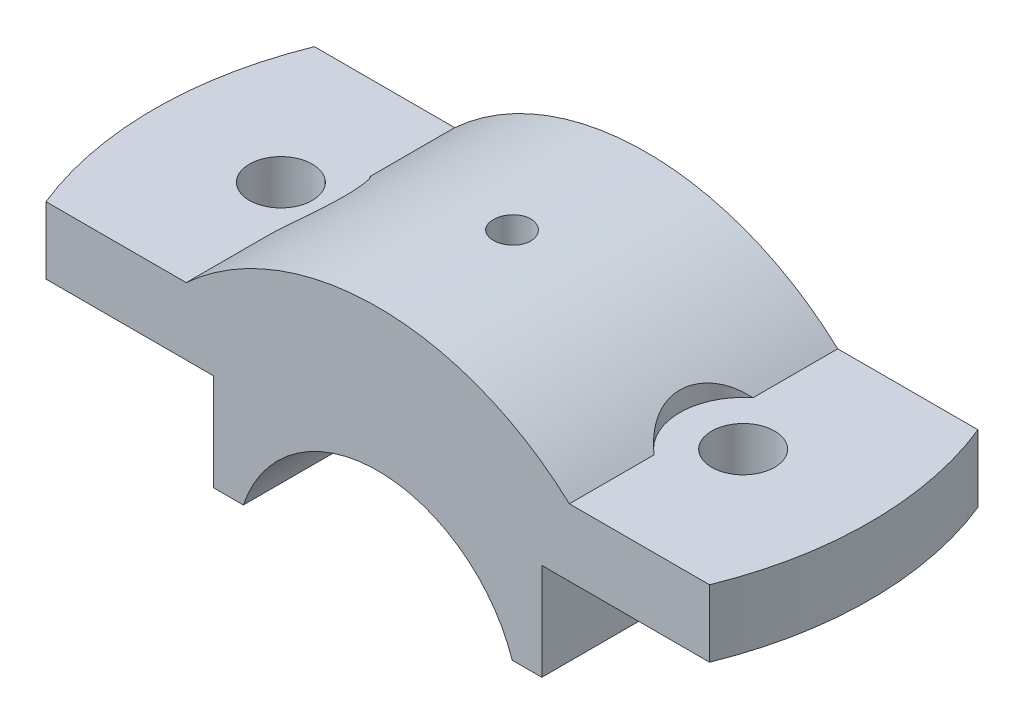
ISO-10303-21;
HEADER;
FILE_DESCRIPTION(('STEP AP214'),'2;1');
FILE_NAME('part.step','',(''),(''),'','','');
FILE_SCHEMA(('AUTOMOTIVE_DESIGN { 1 0 10303 214 1 1 1 1 }'));
ENDSEC;
DATA;
#1=APPLICATION_CONTEXT('core data for automotive mechanical design processes');
#2=APPLICATION_PROTOCOL_DEFINITION('international standard','automotive_design',2000,#1);
#3=PRODUCT_CONTEXT('',#1,'mechanical');
#4=PRODUCT('Part','Part','',(#3));
#5=PRODUCT_RELATED_PRODUCT_CATEGORY('part','',(#4));
#6=PRODUCT_DEFINITION_FORMATION('','',#4);
#7=PRODUCT_DEFINITION_CONTEXT('part definition',#1,'design');
#8=PRODUCT_DEFINITION('design','',#6,#7);
#9=PRODUCT_DEFINITION_SHAPE('','',#8);
#10=(LENGTH_UNIT() NAMED_UNIT(*) SI_UNIT(.MILLI.,.METRE.));
#11=(NAMED_UNIT(*) PLANE_ANGLE_UNIT() SI_UNIT($,.RADIAN.));
#12=(NAMED_UNIT(*) SI_UNIT($,.STERADIAN.) SOLID_ANGLE_UNIT());
#13=UNCERTAINTY_MEASURE_WITH_UNIT(LENGTH_MEASURE(1.E-05),#10,'distance_accuracy_value','');
#14=(GEOMETRIC_REPRESENTATION_CONTEXT(3) GLOBAL_UNCERTAINTY_ASSIGNED_CONTEXT((#13)) GLOBAL_UNIT_ASSIGNED_CONTEXT((#10,
#11,#12)) REPRESENTATION_CONTEXT('',''));
#15=CARTESIAN_POINT('',(0.,0.,0.));
#16=DIRECTION('',(0.,0.,1.));
#17=DIRECTION('',(1.,0.,0.));
#18=AXIS2_PLACEMENT_3D('',#15,#16,#17);
#19=CARTESIAN_POINT('',(0.,0.,18.));
#20=DIRECTION('',(0.,0.,-1.));
#21=DIRECTION('',(-1.,0.,0.));
#22=AXIS2_PLACEMENT_3D('',#19,#20,#21);
#23=CYLINDRICAL_SURFACE('',#22,38.);
#24=CARTESIAN_POINT('',(0.,38.,-2.5));
#25=CARTESIAN_POINT('',(0.140263338640118,37.9999989089088,-2.49999383429658));
#26=CARTESIAN_POINT('',(0.28062451056721,37.9992151008519,-2.48815604592353));
#27=CARTESIAN_POINT('',(0.55747007747557,37.9961636901737,-2.44110328347415));
#28=CARTESIAN_POINT('',(0.693949785301594,37.993894366974,-2.40586120099058));
#29=CARTESIAN_POINT('',(0.958982303444856,37.9881286089382,-2.31301742899112));
#30=CARTESIAN_POINT('',(1.08753929536543,37.9846328280609,-2.25542765374311));
#31=CARTESIAN_POINT('',(1.33312858370056,37.9768071728354,-2.11954286257648));
#32=CARTESIAN_POINT('',(1.45016348693039,37.9724774878122,-2.04125254489449));
#33=CARTESIAN_POINT('',(1.66961202724024,37.9634626250822,-1.86604841348535));
#34=CARTESIAN_POINT('',(1.77200420008546,37.9587769406168,-1.76910773898099));
#35=CARTESIAN_POINT('',(1.95907706932224,37.9495824974991,-1.55941033384726));
#36=CARTESIAN_POINT('',(2.04375702050909,37.9450737462974,-1.44665293809568));
#37=CARTESIAN_POINT('',(2.19306912808149,37.9367376727092,-1.20839964171994));
#38=CARTESIAN_POINT('',(2.25768324964759,37.9329109646397,-1.08289241542834));
#39=CARTESIAN_POINT('',(2.36491418395719,37.9263771482206,-0.822781472424069));
#40=CARTESIAN_POINT('',(2.40753125425532,37.9236700267624,-0.688177862238176));
#41=CARTESIAN_POINT('',(2.46949823281524,37.9196855382056,-0.413903543359487));
#42=CARTESIAN_POINT('',(2.4888820420221,37.9184060881012,-0.274240524678777));
#43=CARTESIAN_POINT('',(2.50393692695256,37.9174149912351,0.00636230037308772));
#44=CARTESIAN_POINT('',(2.49960829570425,37.9177033250994,0.147302090944959));
#45=CARTESIAN_POINT('',(2.46738928684178,37.9198133472868,0.42622651475829));
#46=CARTESIAN_POINT('',(2.43953561602796,37.9216326467839,0.564215408645128));
#47=CARTESIAN_POINT('',(2.36111413978203,37.9265958226422,0.833554930876449));
#48=CARTESIAN_POINT('',(2.31054618626762,37.9297397076388,0.964905515937279));
#49=CARTESIAN_POINT('',(2.18808999165326,37.9370005183096,1.21735765586783));
#50=CARTESIAN_POINT('',(2.1161851246853,37.9411182022647,1.33845112338592));
#51=CARTESIAN_POINT('',(1.95310825671474,37.949861837488,1.56686321005671));
#52=CARTESIAN_POINT('',(1.86193601494282,37.9544877951075,1.67418165704681));
#53=CARTESIAN_POINT('',(1.66270582371165,37.9637372885605,1.87221087327149));
#54=CARTESIAN_POINT('',(1.5546161115177,37.9683608030819,1.962889691217));
#55=CARTESIAN_POINT('',(1.32473052430288,37.9770759456802,2.12481907419045));
#56=CARTESIAN_POINT('',(1.20293464399362,37.9811675735518,2.19606963172216));
#57=CARTESIAN_POINT('',(0.949074486518497,37.9883582687232,2.31711734670214));
#58=CARTESIAN_POINT('',(0.817009617015094,37.9914572787137,2.3669132655151));
#59=CARTESIAN_POINT('',(0.546369095952177,37.9963127799458,2.44361669334005));
#60=CARTESIAN_POINT('',(0.40779352865214,37.9980692885564,2.47052449847701));
#61=CARTESIAN_POINT('',(0.128342446210273,38.0000396241101,2.50064822884408));
#62=CARTESIAN_POINT('',(-0.0125282882294641,38.000256327117,2.50390832373491));
#63=CARTESIAN_POINT('',(-0.292814563294631,37.9991302871387,2.48675954169404));
#64=CARTESIAN_POINT('',(-0.432230112318575,37.9977875531587,2.46635080144191));
#65=CARTESIAN_POINT('',(-0.705523880511243,37.9936956265147,2.40248025604108));
#66=CARTESIAN_POINT('',(-0.839406862626693,37.9909476720577,2.35903874492919));
#67=CARTESIAN_POINT('',(-1.09798213226379,37.9843543930687,2.25035643041511));
#68=CARTESIAN_POINT('',(-1.22267432827147,37.9805090576117,2.18511540998787));
#69=CARTESIAN_POINT('',(-1.45953056554175,37.972145780786,2.03457379070949));
#70=CARTESIAN_POINT('',(-1.57167584294262,37.9676268549948,1.94924372504577));
#71=CARTESIAN_POINT('',(-1.78006588645927,37.9584281419056,1.76098906810813));
#72=CARTESIAN_POINT('',(-1.87631047952117,37.9537483528577,1.65806428536826));
#73=CARTESIAN_POINT('',(-2.05031700979283,37.9447469988241,1.43735113192522));
#74=CARTESIAN_POINT('',(-2.12805026816538,37.94042599635,1.31954012523571));
#75=CARTESIAN_POINT('',(-2.26263133128355,37.9326384937239,1.07251236002989));
#76=CARTESIAN_POINT('',(-2.31947927607399,37.9291719878422,0.943295678000643));
#77=CARTESIAN_POINT('',(-2.41062645747181,37.9234884778725,0.677228855114408));
#78=CARTESIAN_POINT('',(-2.44494367555513,37.9212704775707,0.540384896354325));
#79=CARTESIAN_POINT('',(-2.49011396544167,37.918331354935,0.262862313445205));
#80=CARTESIAN_POINT('',(-2.50096730016957,37.917610215828,0.122183732282941));
#81=CARTESIAN_POINT('',(-2.49889914486141,37.9177465482503,-0.15872961782563));
#82=CARTESIAN_POINT('',(-2.48602273732582,37.9186010263749,-0.298964722357909));
#83=CARTESIAN_POINT('',(-2.43695415591888,37.9217859619314,-0.575276953941644));
#84=CARTESIAN_POINT('',(-2.40076194057307,37.9241164219887,-0.71135407359637));
#85=CARTESIAN_POINT('',(-2.3060994574971,37.9299899650734,-0.975493809097541));
#86=CARTESIAN_POINT('',(-2.2476294724398,37.9335330327144,-1.10355652661122));
#87=CARTESIAN_POINT('',(-2.11007715990922,37.9414324891205,-1.34805374143467));
#88=CARTESIAN_POINT('',(-2.03099533692233,37.9457888579789,-1.46448852324829));
#89=CARTESIAN_POINT('',(-1.85429682254945,37.954833700614,-1.6826538156131));
#90=CARTESIAN_POINT('',(-1.75664736286434,37.9595227521995,-1.78435776145447));
#91=CARTESIAN_POINT('',(-1.54563286085881,37.9686995719977,-1.96996578929361));
#92=CARTESIAN_POINT('',(-1.43226398542783,37.9731872907619,-2.05386551714568));
#93=CARTESIAN_POINT('',(-1.19288750338032,37.9814608860298,-2.20155217296298));
#94=CARTESIAN_POINT('',(-1.06686338419816,37.985245826722,-2.26531236139276));
#95=CARTESIAN_POINT('',(-0.805964550763268,37.9916751144093,-2.37068975281806));
#96=CARTESIAN_POINT('',(-0.671100383637565,37.9943207931204,-2.41233282251758));
#97=CARTESIAN_POINT('',(-0.446179257536448,37.9974820960572,-2.46150065465309));
#98=CARTESIAN_POINT('',(-0.357575215516554,37.9984220996303,-2.47591916887037));
#99=CARTESIAN_POINT('',(-0.179327446866816,37.9996813999403,-2.49517080528276));
#100=CARTESIAN_POINT('',(-0.0896837218472526,38.0000006976386,-2.50000394232189));
#101=CARTESIAN_POINT('',(0.,38.,-2.5));
#102=B_SPLINE_CURVE_WITH_KNOTS('',3,(#24,#25,#26,#27,#28,#29,#30,#31,#32,#33,#34,#35,#36,#37,
#38,#39,#40,#41,#42,#43,#44,#45,#46,#47,#48,#49,#50,#51,#52,#53,#54,#55,#56,#57,#58,#59,#60,#61,
#62,#63,#64,#65,#66,#67,#68,#69,#70,#71,#72,#73,#74,#75,#76,#77,#78,#79,#80,#81,#82,#83,#84,#85,
#86,#87,#88,#89,#90,#91,#92,#93,#94,#95,#96,#97,#98,#99,#100,#101),.UNSPECIFIED.,.T.,.F.,(4,2,2,
2,2,2,2,2,2,2,2,2,2,2,2,2,2,2,2,2,2,2,2,2,2,2,2,2,2,2,2,2,2,2,2,2,2,2,4),(0.,0.420462610994174,
0.841413081079642,1.26213943668888,1.68277038524409,2.10401173600148,2.52527080604525,
2.94690740790405,3.36853907287704,3.78955475970551,4.21056524381557,4.63092002409859,
5.05127754486029,5.47196347503219,5.89265466249841,6.3141453927018,6.73563628553362,
7.15715150893449,7.57866127871497,7.99938354099965,8.42010337376709,8.84045312732506,
9.26080706580024,9.68178146800254,10.1027604515455,10.5243874578755,10.9460116369672,
11.3672989129968,11.7885814682647,12.2090644828285,12.629548245355,13.0500266727248,
13.4704948096136,13.8917119970443,14.3130320776634,14.7349092218268,15.1562918740891,
15.4251341147866,15.6939759391519),.UNSPECIFIED.);
#103=CARTESIAN_POINT('',(0.,38.,-2.5));
#104=VERTEX_POINT('',#103);
#105=EDGE_CURVE('E11',#104,#104,#102,.T.);
#106=ORIENTED_EDGE('',*,*,#105,.T.);
#107=EDGE_LOOP('',(#106));
#108=FACE_BOUND('',#107,.T.);
#109=CARTESIAN_POINT('',(25.6904651573303,28.,-6.63768331230679));
#110=CARTESIAN_POINT('',(25.5360851043424,28.1416681018721,-6.51420867249736));
#111=CARTESIAN_POINT('',(25.3836215551735,28.2791823336497,-6.38340380017067));
#112=CARTESIAN_POINT('',(25.0841053598261,28.5451833866574,-6.1068595072457));
#113=CARTESIAN_POINT('',(24.9370580895264,28.6736613482155,-5.96110576476093));
#114=CARTESIAN_POINT('',(24.6491941230388,28.9215085426632,-5.653491442262));
#115=CARTESIAN_POINT('',(24.508431723833,29.0408031542341,-5.49151942353939));
#116=CARTESIAN_POINT('',(24.2363075607749,29.2682904084011,-5.15263687836669));
#117=CARTESIAN_POINT('',(24.1049430857226,29.3764862568107,-4.97573069263072));
#118=CARTESIAN_POINT('',(23.8528205053459,29.5815743674557,-4.60631493821573));
#119=CARTESIAN_POINT('',(23.7321338833277,29.6783916917415,-4.41371469093334));
#120=CARTESIAN_POINT('',(23.5043908446779,29.85908164754,-4.01479632179465));
#121=CARTESIAN_POINT('',(23.3973358972541,29.942952883943,-3.8084767249227));
#122=CARTESIAN_POINT('',(23.1992536300817,30.0966827286364,-3.38422419101505));
#123=CARTESIAN_POINT('',(23.1081729651955,30.1665880882949,-3.16633319991271));
#124=CARTESIAN_POINT('',(22.9434688496595,30.2920447623401,-2.72008092153075));
#125=CARTESIAN_POINT('',(22.869842066784,30.347598816803,-2.49172164276594));
#126=CARTESIAN_POINT('',(22.7499342032063,30.4375648556656,-2.05682098381957));
#127=CARTESIAN_POINT('',(22.7013462567531,30.4737833576563,-1.85128534823192));
#128=CARTESIAN_POINT('',(22.6194172898017,30.534645499234,-1.43551725204116));
#129=CARTESIAN_POINT('',(22.5860747992536,30.5592902548309,-1.22528524633891));
#130=CARTESIAN_POINT('',(22.5352129551669,30.5968164834569,-0.801799591498537));
#131=CARTESIAN_POINT('',(22.5176992505084,30.6096937569973,-0.58854489119393));
#132=CARTESIAN_POINT('',(22.4988301660851,30.6235658271181,-0.160939560666242));
#133=CARTESIAN_POINT('',(22.4974739036633,30.624561272785,0.053411009051125));
#134=CARTESIAN_POINT('',(22.5103301119086,30.6151119876343,0.461997479818142));
#135=CARTESIAN_POINT('',(22.5231488228924,30.6056914251709,0.656303160135768));
#136=CARTESIAN_POINT('',(22.5619809221014,30.5770763766543,1.0428625929884));
#137=CARTESIAN_POINT('',(22.5879939672906,30.5578821447042,1.23511639873688));
#138=CARTESIAN_POINT('',(22.6528192304938,30.5098574663833,1.61613906729809));
#139=CARTESIAN_POINT('',(22.6916259266854,30.4810311771979,1.80490939654948));
#140=CARTESIAN_POINT('',(22.7814851533843,30.4139289484325,2.17779604427593));
#141=CARTESIAN_POINT('',(22.8325379785097,30.3756527815061,2.36191225066402));
#142=CARTESIAN_POINT('',(22.9463727274414,30.2897519777021,2.72495933677602));
#143=CARTESIAN_POINT('',(23.0091940590921,30.2420959034169,2.90387039063446));
#144=CARTESIAN_POINT('',(23.1456283742011,30.1378044455699,3.25489148863349));
#145=CARTESIAN_POINT('',(23.2192449894415,30.0811660396201,3.42699921914349));
#146=CARTESIAN_POINT('',(23.3763137314078,29.9592695660632,3.76349373210636));
#147=CARTESIAN_POINT('',(23.4597660818508,29.8940113023904,3.92788033882065));
#148=CARTESIAN_POINT('',(23.6355270453779,29.7552415450916,4.24828704232642));
#149=CARTESIAN_POINT('',(23.7278387953854,29.6817271265587,4.40430414494655));
#150=CARTESIAN_POINT('',(23.9282386479047,29.5204551498758,4.71995510834892));
#151=CARTESIAN_POINT('',(24.0370002176616,29.432022004933,4.87881602386906));
#152=CARTESIAN_POINT('',(24.2623844714665,29.2465042091278,5.18563329619881));
#153=CARTESIAN_POINT('',(24.379010630913,29.1494157272481,5.33358477081362));
#154=CARTESIAN_POINT('',(24.6187042069683,28.9472618083659,5.61815393006347));
#155=CARTESIAN_POINT('',(24.7417672458198,28.8422017715012,5.75477915839728));
#156=CARTESIAN_POINT('',(24.9931857635631,28.6246099475779,6.01673825944901));
#157=CARTESIAN_POINT('',(25.121541230047,28.5120781780363,6.14207215863705));
#158=CARTESIAN_POINT('',(25.3239635142993,28.3320696328102,6.32788833390875));
#159=CARTESIAN_POINT('',(25.3966039536003,28.2669811541268,6.39227987552887));
#160=CARTESIAN_POINT('',(25.5428336292653,28.1349133065772,6.51755974656753));
#161=CARTESIAN_POINT('',(25.6164208573994,28.0679376662269,6.57845434819239));
#162=CARTESIAN_POINT('',(25.6904651573302,28.0000000000002,6.6376833123071));
#163=B_SPLINE_CURVE_WITH_KNOTS('',3,(#109,#110,#111,#112,#113,#114,#115,#116,#117,#118,#119,
#120,#121,#122,#123,#124,#125,#126,#127,#128,#129,#130,#131,#132,#133,#134,#135,#136,#137,#138,
#139,#140,#141,#142,#143,#144,#145,#146,#147,#148,#149,#150,#151,#152,#153,#154,#155,#156,#157,
#158,#159,#160,#161,#162),.UNSPECIFIED.,.F.,.F.,(4,2,2,2,2,2,2,2,2,2,2,2,2,2,2,2,2,2,2,2,2,2,2,
2,2,2,4),(0.,0.729592400834074,1.45989044138352,2.19560470883999,2.93110586753776,
3.67120763552799,4.41138910352643,5.14904966030398,5.88656927223681,6.52855006409986,
7.1704689396149,7.81261680885222,8.45472959834447,9.03890309081733,9.62306139629815,
10.2069679046447,10.7908884620571,11.3768004587137,11.9629100238154,12.549032922753,
13.1353641263273,13.7703169673958,14.4055522594533,15.040361004022,15.6751682603777,
16.0257258218314,16.3756336015194),.UNSPECIFIED.);
#164=CARTESIAN_POINT('',(25.6904651573303,28.,-6.63768331230677));
#165=VERTEX_POINT('',#164);
#166=CARTESIAN_POINT('',(25.6904651573303,28.,6.63768331230682));
#167=VERTEX_POINT('',#166);
#168=EDGE_CURVE('E142',#165,#167,#163,.T.);
#169=ORIENTED_EDGE('',*,*,#168,.F.);
#170=DIRECTION('',(0.,0.,-1.));
#171=VECTOR('',#170,1.);
#172=CARTESIAN_POINT('',(25.6904651573303,28.,18.));
#173=LINE('',#172,#171);
#174=CARTESIAN_POINT('',(25.6904651573303,28.,-18.));
#175=VERTEX_POINT('',#174);
#176=EDGE_CURVE('E148',#165,#175,#173,.T.);
#177=ORIENTED_EDGE('',*,*,#176,.T.);
#178=CARTESIAN_POINT('',(0.,0.,-18.));
#179=DIRECTION('',(0.,0.,1.));
#180=DIRECTION('',(1.,0.,0.));
#181=AXIS2_PLACEMENT_3D('',#178,#179,#180);
#182=CIRCLE('',#181,38.);
#183=CARTESIAN_POINT('',(-25.6904651573303,28.,-18.));
#184=VERTEX_POINT('',#183);
#185=EDGE_CURVE('E326',#175,#184,#182,.T.);
#186=ORIENTED_EDGE('',*,*,#185,.T.);
#187=DIRECTION('',(0.,0.,-1.));
#188=VECTOR('',#187,1.);
#189=CARTESIAN_POINT('',(-25.6904651573303,28.,18.));
#190=LINE('',#189,#188);
#191=CARTESIAN_POINT('',(-25.6904651573303,28.,-6.6376833123068));
#192=VERTEX_POINT('',#191);
#193=EDGE_CURVE('E184',#192,#184,#190,.T.);
#194=ORIENTED_EDGE('',*,*,#193,.F.);
#195=CARTESIAN_POINT('',(-25.6904651573303,28.,6.6376833123068));
#196=CARTESIAN_POINT('',(-25.5360851043424,28.1416681018721,6.51420867249737));
#197=CARTESIAN_POINT('',(-25.3836215551735,28.2791823336498,6.38340380017068));
#198=CARTESIAN_POINT('',(-25.0841053598261,28.5451833866574,6.10685950724571));
#199=CARTESIAN_POINT('',(-24.9370580895264,28.6736613482156,5.96110576476094));
#200=CARTESIAN_POINT('',(-24.6491941230388,28.9215085426633,5.65349144226201));
#201=CARTESIAN_POINT('',(-24.508431723833,29.0408031542341,5.4915194235394));
#202=CARTESIAN_POINT('',(-24.2363075607749,29.2682904084011,5.1526368783667));
#203=CARTESIAN_POINT('',(-24.1049430857226,29.3764862568107,4.97573069263072));
#204=CARTESIAN_POINT('',(-23.8528205053459,29.5815743674557,4.60631493821573));
#205=CARTESIAN_POINT('',(-23.7321338833277,29.6783916917415,4.41371469093335));
#206=CARTESIAN_POINT('',(-23.5043908446779,29.85908164754,4.01479632179465));
#207=CARTESIAN_POINT('',(-23.3973358972541,29.942952883943,3.8084767249227));
#208=CARTESIAN_POINT('',(-23.1992536300817,30.0966827286364,3.38422419101505));
#209=CARTESIAN_POINT('',(-23.1081729651954,30.1665880882949,3.16633319991271));
#210=CARTESIAN_POINT('',(-22.9434688496595,30.2920447623401,2.72008092153075));
#211=CARTESIAN_POINT('',(-22.869842066784,30.347598816803,2.49172164276594));
#212=CARTESIAN_POINT('',(-22.7499342032063,30.4375648556656,2.05682098381957));
#213=CARTESIAN_POINT('',(-22.7013462567531,30.4737833576563,1.85128534823192));
#214=CARTESIAN_POINT('',(-22.6194172898017,30.534645499234,1.43551725204116));
#215=CARTESIAN_POINT('',(-22.5860747992536,30.5592902548309,1.22528524633891));
#216=CARTESIAN_POINT('',(-22.5352129551669,30.5968164834569,0.801799591498536));
#217=CARTESIAN_POINT('',(-22.5176992505084,30.6096937569973,0.58854489119393));
#218=CARTESIAN_POINT('',(-22.4988301660851,30.6235658271181,0.160939560666243));
#219=CARTESIAN_POINT('',(-22.4974739036633,30.624561272785,-0.0534110090511244));
#220=CARTESIAN_POINT('',(-22.5103301119086,30.6151119876343,-0.461997479818141));
#221=CARTESIAN_POINT('',(-22.5231488228924,30.6056914251709,-0.656303160135767));
#222=CARTESIAN_POINT('',(-22.5619809221014,30.5770763766543,-1.0428625929884));
#223=CARTESIAN_POINT('',(-22.5879939672906,30.5578821447042,-1.23511639873688));
#224=CARTESIAN_POINT('',(-22.6528192304938,30.5098574663833,-1.61613906729809));
#225=CARTESIAN_POINT('',(-22.6916259266854,30.4810311771979,-1.80490939654948));
#226=CARTESIAN_POINT('',(-22.7814851533843,30.4139289484325,-2.17779604427593));
#227=CARTESIAN_POINT('',(-22.8325379785097,30.3756527815061,-2.36191225066402));
#228=CARTESIAN_POINT('',(-22.9463727274414,30.2897519777021,-2.72495933677602));
#229=CARTESIAN_POINT('',(-23.0091940590921,30.2420959034169,-2.90387039063446));
#230=CARTESIAN_POINT('',(-23.1456283742011,30.1378044455698,-3.25489148863349));
#231=CARTESIAN_POINT('',(-23.2192449894415,30.0811660396201,-3.42699921914349));
#232=CARTESIAN_POINT('',(-23.3763137314078,29.9592695660632,-3.76349373210636));
#233=CARTESIAN_POINT('',(-23.4597660818508,29.8940113023904,-3.92788033882065));
#234=CARTESIAN_POINT('',(-23.6355270453779,29.7552415450916,-4.24828704232642));
#235=CARTESIAN_POINT('',(-23.7278387953854,29.6817271265587,-4.40430414494655));
#236=CARTESIAN_POINT('',(-23.9282386479047,29.5204551498758,-4.71995510834891));
#237=CARTESIAN_POINT('',(-24.0370002176616,29.432022004933,-4.87881602386905));
#238=CARTESIAN_POINT('',(-24.2623844714665,29.2465042091278,-5.1856332961988));
#239=CARTESIAN_POINT('',(-24.379010630913,29.1494157272481,-5.33358477081361));
#240=CARTESIAN_POINT('',(-24.6187042069683,28.9472618083659,-5.61815393006346));
#241=CARTESIAN_POINT('',(-24.7417672458198,28.8422017715012,-5.75477915839727));
#242=CARTESIAN_POINT('',(-24.9931857635631,28.6246099475779,-6.016738259449));
#243=CARTESIAN_POINT('',(-25.121541230047,28.5120781780363,-6.14207215863704));
#244=CARTESIAN_POINT('',(-25.3239635142993,28.3320696328102,-6.32788833390874));
#245=CARTESIAN_POINT('',(-25.3966039536003,28.2669811541268,-6.39227987552885));
#246=CARTESIAN_POINT('',(-25.5428336292653,28.1349133065772,-6.5175597465675));
#247=CARTESIAN_POINT('',(-25.6164208573994,28.0679376662269,-6.57845434819236));
#248=CARTESIAN_POINT('',(-25.6904651573302,28.0000000000002,-6.63768331230706));
#249=B_SPLINE_CURVE_WITH_KNOTS('',3,(#195,#196,#197,#198,#199,#200,#201,#202,#203,#204,#205,
#206,#207,#208,#209,#210,#211,#212,#213,#214,#215,#216,#217,#218,#219,#220,#221,#222,#223,#224,
#225,#226,#227,#228,#229,#230,#231,#232,#233,#234,#235,#236,#237,#238,#239,#240,#241,#242,#243,
#244,#245,#246,#247,#248),.UNSPECIFIED.,.F.,.F.,(4,2,2,2,2,2,2,2,2,2,2,2,2,2,2,2,2,2,2,2,2,2,2,
2,2,2,4),(0.,0.729592400834075,1.45989044138352,2.19560470883999,2.93110586753776,
3.67120763552799,4.41138910352644,5.14904966030398,5.88656927223681,6.52855006409986,
7.1704689396149,7.81261680885222,8.45472959834447,9.03890309081734,9.62306139629815,
10.2069679046447,10.7908884620571,11.3768004587137,11.9629100238154,12.549032922753,
13.1353641263273,13.7703169673958,14.4055522594533,15.040361004022,15.6751682603777,
16.0257258218313,16.3756336015193),.UNSPECIFIED.);
#250=CARTESIAN_POINT('',(-25.6904651573303,28.,6.6376833123068));
#251=VERTEX_POINT('',#250);
#252=EDGE_CURVE('E48',#251,#192,#249,.T.);
#253=ORIENTED_EDGE('',*,*,#252,.F.);
#254=CARTESIAN_POINT('',(-25.6904651573303,28.,18.));
#255=VERTEX_POINT('',#254);
#256=EDGE_CURVE('E185',#255,#251,#190,.T.);
#257=ORIENTED_EDGE('',*,*,#256,.F.);
#258=CARTESIAN_POINT('',(0.,0.,18.));
#259=DIRECTION('',(0.,0.,1.));
#260=DIRECTION('',(1.,0.,0.));
#261=AXIS2_PLACEMENT_3D('',#258,#259,#260);
#262=CIRCLE('',#261,38.);
#263=CARTESIAN_POINT('',(25.6904651573303,28.,18.));
#264=VERTEX_POINT('',#263);
#265=EDGE_CURVE('E327',#264,#255,#262,.T.);
#266=ORIENTED_EDGE('',*,*,#265,.F.);
#267=EDGE_CURVE('E151',#264,#167,#173,.T.);
#268=ORIENTED_EDGE('',*,*,#267,.T.);
#269=EDGE_LOOP('',(#169,#177,#186,#194,#253,#257,#266,#268));
#270=FACE_BOUND('',#269,.T.);
#271=ADVANCED_FACE('F35',(#108,#270),#23,.T.);
#272=CARTESIAN_POINT('',(0.,0.,18.));
#273=DIRECTION('',(0.,0.,1.));
#274=DIRECTION('',(1.,0.,0.));
#275=AXIS2_PLACEMENT_3D('',#272,#273,#274);
#276=PLANE('',#275);
#277=DIRECTION('',(1.,0.,0.));
#278=VECTOR('',#277,1.);
#279=CARTESIAN_POINT('',(22.,19.,18.));
#280=LINE('',#279,#278);
#281=CARTESIAN_POINT('',(22.,19.,18.));
#282=VERTEX_POINT('',#281);
#283=CARTESIAN_POINT('',(44.497190922574,19.,18.));
#284=VERTEX_POINT('',#283);
#285=EDGE_CURVE('E162',#282,#284,#280,.T.);
#286=ORIENTED_EDGE('',*,*,#285,.T.);
#287=DIRECTION('',(0.,-1.,0.));
#288=VECTOR('',#287,1.);
#289=CARTESIAN_POINT('',(44.497190922574,38.,18.));
#290=LINE('',#289,#288);
#291=CARTESIAN_POINT('',(44.497190922574,28.,18.));
#292=VERTEX_POINT('',#291);
#293=EDGE_CURVE('E317',#292,#284,#290,.T.);
#294=ORIENTED_EDGE('',*,*,#293,.F.);
#295=DIRECTION('',(-1.,0.,0.));
#296=VECTOR('',#295,1.);
#297=CARTESIAN_POINT('',(49.,28.,18.));
#298=LINE('',#297,#296);
#299=EDGE_CURVE('E159',#292,#264,#298,.T.);
#300=ORIENTED_EDGE('',*,*,#299,.T.);
#301=ORIENTED_EDGE('',*,*,#265,.T.);
#302=DIRECTION('',(-1.,0.,0.));
#303=VECTOR('',#302,1.);
#304=CARTESIAN_POINT('',(-25.6904651573303,28.,18.));
#305=LINE('',#304,#303);
#306=CARTESIAN_POINT('',(-44.497190922574,28.,18.));
#307=VERTEX_POINT('',#306);
#308=EDGE_CURVE('E330',#255,#307,#305,.T.);
#309=ORIENTED_EDGE('',*,*,#308,.T.);
#310=DIRECTION('',(0.,-1.,0.));
#311=VECTOR('',#310,1.);
#312=CARTESIAN_POINT('',(-44.497190922574,38.,18.));
#313=LINE('',#312,#311);
#314=CARTESIAN_POINT('',(-44.497190922574,19.,18.));
#315=VERTEX_POINT('',#314);
#316=EDGE_CURVE('E321',#307,#315,#313,.T.);
#317=ORIENTED_EDGE('',*,*,#316,.T.);
#318=DIRECTION('',(1.,0.,0.));
#319=VECTOR('',#318,1.);
#320=CARTESIAN_POINT('',(-22.,19.,18.));
#321=LINE('',#320,#319);
#322=CARTESIAN_POINT('',(-22.,19.,18.));
#323=VERTEX_POINT('',#322);
#324=EDGE_CURVE('E333',#315,#323,#321,.T.);
#325=ORIENTED_EDGE('',*,*,#324,.T.);
#326=DIRECTION('',(0.,-1.,0.));
#327=VECTOR('',#326,1.);
#328=CARTESIAN_POINT('',(-22.,6.,18.));
#329=LINE('',#328,#327);
#330=CARTESIAN_POINT('',(-22.,6.,18.));
#331=VERTEX_POINT('',#330);
#332=EDGE_CURVE('E335',#323,#331,#329,.T.);
#333=ORIENTED_EDGE('',*,*,#332,.T.);
#334=DIRECTION('',(1.,0.,0.));
#335=VECTOR('',#334,1.);
#336=CARTESIAN_POINT('',(-18.0277563773199,6.,18.));
#337=LINE('',#336,#335);
#338=CARTESIAN_POINT('',(-18.0277563773199,6.,18.));
#339=VERTEX_POINT('',#338);
#340=EDGE_CURVE('E337',#331,#339,#337,.T.);
#341=ORIENTED_EDGE('',*,*,#340,.T.);
#342=CARTESIAN_POINT('',(0.,0.,18.));
#343=DIRECTION('',(0.,0.,-1.));
#344=DIRECTION('',(1.,0.,0.));
#345=AXIS2_PLACEMENT_3D('',#342,#343,#344);
#346=CIRCLE('',#345,19.);
#347=CARTESIAN_POINT('',(18.0277563773199,6.,18.));
#348=VERTEX_POINT('',#347);
#349=EDGE_CURVE('E339',#339,#348,#346,.T.);
#350=ORIENTED_EDGE('',*,*,#349,.T.);
#351=DIRECTION('',(1.,0.,0.));
#352=VECTOR('',#351,1.);
#353=CARTESIAN_POINT('',(18.0277563773199,6.,18.));
#354=LINE('',#353,#352);
#355=CARTESIAN_POINT('',(22.,6.,18.));
#356=VERTEX_POINT('',#355);
#357=EDGE_CURVE('E341',#348,#356,#354,.T.);
#358=ORIENTED_EDGE('',*,*,#357,.T.);
#359=DIRECTION('',(0.,1.,0.));
#360=VECTOR('',#359,1.);
#361=CARTESIAN_POINT('',(22.,6.,18.));
#362=LINE('',#361,#360);
#363=EDGE_CURVE('E343',#356,#282,#362,.T.);
#364=ORIENTED_EDGE('',*,*,#363,.T.);
#365=EDGE_LOOP('',(#286,#294,#300,#301,#309,#317,#325,#333,#341,#350,#358,#364));
#366=FACE_BOUND('',#365,.T.);
#367=ADVANCED_FACE('F228',(#366),#276,.T.);
#368=CARTESIAN_POINT('',(0.,0.,-18.));
#369=DIRECTION('',(0.,0.,1.));
#370=DIRECTION('',(1.,0.,0.));
#371=AXIS2_PLACEMENT_3D('',#368,#369,#370);
#372=PLANE('',#371);
#373=DIRECTION('',(0.,-1.,0.));
#374=VECTOR('',#373,1.);
#375=CARTESIAN_POINT('',(44.497190922574,38.,-18.));
#376=LINE('',#375,#374);
#377=CARTESIAN_POINT('',(44.497190922574,28.,-18.));
#378=VERTEX_POINT('',#377);
#379=CARTESIAN_POINT('',(44.497190922574,19.,-18.));
#380=VERTEX_POINT('',#379);
#381=EDGE_CURVE('E314',#378,#380,#376,.T.);
#382=ORIENTED_EDGE('',*,*,#381,.T.);
#383=DIRECTION('',(1.,0.,0.));
#384=VECTOR('',#383,1.);
#385=CARTESIAN_POINT('',(22.,19.,-18.));
#386=LINE('',#385,#384);
#387=CARTESIAN_POINT('',(22.,19.,-18.));
#388=VERTEX_POINT('',#387);
#389=EDGE_CURVE('E362',#388,#380,#386,.T.);
#390=ORIENTED_EDGE('',*,*,#389,.F.);
#391=DIRECTION('',(0.,1.,0.));
#392=VECTOR('',#391,1.);
#393=CARTESIAN_POINT('',(22.,6.,-18.));
#394=LINE('',#393,#392);
#395=CARTESIAN_POINT('',(22.,6.,-18.));
#396=VERTEX_POINT('',#395);
#397=EDGE_CURVE('E361',#396,#388,#394,.T.);
#398=ORIENTED_EDGE('',*,*,#397,.F.);
#399=DIRECTION('',(1.,0.,0.));
#400=VECTOR('',#399,1.);
#401=CARTESIAN_POINT('',(18.0277563773199,6.,-18.));
#402=LINE('',#401,#400);
#403=CARTESIAN_POINT('',(18.0277563773199,6.,-18.));
#404=VERTEX_POINT('',#403);
#405=EDGE_CURVE('E359',#404,#396,#402,.T.);
#406=ORIENTED_EDGE('',*,*,#405,.F.);
#407=CARTESIAN_POINT('',(0.,0.,-18.));
#408=DIRECTION('',(0.,0.,-1.));
#409=DIRECTION('',(1.,0.,0.));
#410=AXIS2_PLACEMENT_3D('',#407,#408,#409);
#411=CIRCLE('',#410,19.);
#412=CARTESIAN_POINT('',(-18.0277563773199,6.,-18.));
#413=VERTEX_POINT('',#412);
#414=EDGE_CURVE('E357',#413,#404,#411,.T.);
#415=ORIENTED_EDGE('',*,*,#414,.F.);
#416=DIRECTION('',(1.,0.,0.));
#417=VECTOR('',#416,1.);
#418=CARTESIAN_POINT('',(-18.0277563773199,6.,-18.));
#419=LINE('',#418,#417);
#420=CARTESIAN_POINT('',(-22.,6.,-18.));
#421=VERTEX_POINT('',#420);
#422=EDGE_CURVE('E355',#421,#413,#419,.T.);
#423=ORIENTED_EDGE('',*,*,#422,.F.);
#424=DIRECTION('',(0.,-1.,0.));
#425=VECTOR('',#424,1.);
#426=CARTESIAN_POINT('',(-22.,6.,-18.));
#427=LINE('',#426,#425);
#428=CARTESIAN_POINT('',(-22.,19.,-18.));
#429=VERTEX_POINT('',#428);
#430=EDGE_CURVE('E353',#429,#421,#427,.T.);
#431=ORIENTED_EDGE('',*,*,#430,.F.);
#432=DIRECTION('',(1.,0.,0.));
#433=VECTOR('',#432,1.);
#434=CARTESIAN_POINT('',(-22.,19.,-18.));
#435=LINE('',#434,#433);
#436=CARTESIAN_POINT('',(-44.497190922574,19.,-18.));
#437=VERTEX_POINT('',#436);
#438=EDGE_CURVE('E351',#437,#429,#435,.T.);
#439=ORIENTED_EDGE('',*,*,#438,.F.);
#440=DIRECTION('',(0.,-1.,0.));
#441=VECTOR('',#440,1.);
#442=CARTESIAN_POINT('',(-44.497190922574,38.,-18.));
#443=LINE('',#442,#441);
#444=CARTESIAN_POINT('',(-44.497190922574,28.,-18.));
#445=VERTEX_POINT('',#444);
#446=EDGE_CURVE('E187',#445,#437,#443,.T.);
#447=ORIENTED_EDGE('',*,*,#446,.F.);
#448=DIRECTION('',(-1.,0.,0.));
#449=VECTOR('',#448,1.);
#450=CARTESIAN_POINT('',(-25.6904651573303,28.,-18.));
#451=LINE('',#450,#449);
#452=EDGE_CURVE('E348',#184,#445,#451,.T.);
#453=ORIENTED_EDGE('',*,*,#452,.F.);
#454=ORIENTED_EDGE('',*,*,#185,.F.);
#455=DIRECTION('',(-1.,0.,0.));
#456=VECTOR('',#455,1.);
#457=CARTESIAN_POINT('',(49.,28.,-18.));
#458=LINE('',#457,#456);
#459=EDGE_CURVE('E157',#378,#175,#458,.T.);
#460=ORIENTED_EDGE('',*,*,#459,.F.);
#461=EDGE_LOOP('',(#382,#390,#398,#406,#415,#423,#431,#439,#447,#453,#454,#460));
#462=FACE_BOUND('',#461,.T.);
#463=ADVANCED_FACE('F231',(#462),#372,.F.);
#464=CARTESIAN_POINT('',(22.,19.,18.));
#465=DIRECTION('',(0.,1.,0.));
#466=DIRECTION('',(0.,0.,1.));
#467=AXIS2_PLACEMENT_3D('',#464,#465,#466);
#468=PLANE('',#467);
#469=CARTESIAN_POINT('',(31.,19.,0.));
#470=DIRECTION('',(0.,1.,0.));
#471=DIRECTION('',(0.,0.,1.));
#472=AXIS2_PLACEMENT_3D('',#469,#470,#471);
#473=CIRCLE('',#472,4.22172305265286);
#474=CARTESIAN_POINT('',(31.,19.,4.22172305265286));
#475=VERTEX_POINT('',#474);
#476=EDGE_CURVE('E195',#475,#475,#473,.F.);
#477=ORIENTED_EDGE('',*,*,#476,.F.);
#478=EDGE_LOOP('',(#477));
#479=FACE_BOUND('',#478,.T.);
#480=CARTESIAN_POINT('',(0.,19.,0.));
#481=DIRECTION('',(0.,1.,0.));
#482=DIRECTION('',(0.,0.,1.));
#483=AXIS2_PLACEMENT_3D('',#480,#481,#482);
#484=CIRCLE('',#483,48.);
#485=EDGE_CURVE('E312',#284,#380,#484,.T.);
#486=ORIENTED_EDGE('',*,*,#485,.F.);
#487=ORIENTED_EDGE('',*,*,#285,.F.);
#488=DIRECTION('',(0.,0.,-1.));
#489=VECTOR('',#488,1.);
#490=CARTESIAN_POINT('',(22.,19.,18.));
#491=LINE('',#490,#489);
#492=EDGE_CURVE('E161',#282,#388,#491,.T.);
#493=ORIENTED_EDGE('',*,*,#492,.T.);
#494=ORIENTED_EDGE('',*,*,#389,.T.);
#495=EDGE_LOOP('',(#486,#487,#493,#494));
#496=FACE_BOUND('',#495,.T.);
#497=ADVANCED_FACE('F235',(#479,#496),#468,.F.);
#498=CARTESIAN_POINT('',(49.,28.,18.));
#499=DIRECTION('',(0.,-1.,0.));
#500=DIRECTION('',(1.,0.,0.));
#501=AXIS2_PLACEMENT_3D('',#498,#499,#500);
#502=PLANE('',#501);
#503=ORIENTED_EDGE('',*,*,#176,.F.);
#504=CARTESIAN_POINT('',(31.,28.,0.));
#505=DIRECTION('',(0.,1.,0.));
#506=DIRECTION('',(1.,0.,0.));
#507=AXIS2_PLACEMENT_3D('',#504,#505,#506);
#508=CIRCLE('',#507,8.5);
#509=EDGE_CURVE('E55',#165,#167,#508,.T.);
#510=ORIENTED_EDGE('',*,*,#509,.T.);
#511=ORIENTED_EDGE('',*,*,#267,.F.);
#512=ORIENTED_EDGE('',*,*,#299,.F.);
#513=CARTESIAN_POINT('',(0.,28.,0.));
#514=DIRECTION('',(0.,-1.,0.));
#515=DIRECTION('',(1.,0.,0.));
#516=AXIS2_PLACEMENT_3D('',#513,#514,#515);
#517=CIRCLE('',#516,48.);
#518=EDGE_CURVE('E189',#378,#292,#517,.T.);
#519=ORIENTED_EDGE('',*,*,#518,.F.);
#520=ORIENTED_EDGE('',*,*,#459,.T.);
#521=EDGE_LOOP('',(#503,#510,#511,#512,#519,#520));
#522=FACE_BOUND('',#521,.T.);
#523=CARTESIAN_POINT('',(31.,28.,0.));
#524=DIRECTION('',(0.,-1.,0.));
#525=DIRECTION('',(1.,0.,0.));
#526=AXIS2_PLACEMENT_3D('',#523,#524,#525);
#527=CIRCLE('',#526,4.22172305265286);
#528=CARTESIAN_POINT('',(35.2217230526529,28.,0.));
#529=VERTEX_POINT('',#528);
#530=EDGE_CURVE('E191',#529,#529,#527,.F.);
#531=ORIENTED_EDGE('',*,*,#530,.F.);
#532=EDGE_LOOP('',(#531));
#533=FACE_BOUND('',#532,.T.);
#534=ADVANCED_FACE('F153',(#522,#533),#502,.F.);
#535=CARTESIAN_POINT('',(-25.6904651573303,28.,18.));
#536=DIRECTION('',(0.,-1.,0.));
#537=DIRECTION('',(1.,0.,0.));
#538=AXIS2_PLACEMENT_3D('',#535,#536,#537);
#539=PLANE('',#538);
#540=ORIENTED_EDGE('',*,*,#256,.T.);
#541=CARTESIAN_POINT('',(-31.,28.,0.));
#542=DIRECTION('',(0.,1.,0.));
#543=DIRECTION('',(-1.,0.,0.));
#544=AXIS2_PLACEMENT_3D('',#541,#542,#543);
#545=CIRCLE('',#544,8.5);
#546=EDGE_CURVE('E63',#251,#192,#545,.T.);
#547=ORIENTED_EDGE('',*,*,#546,.T.);
#548=ORIENTED_EDGE('',*,*,#193,.T.);
#549=ORIENTED_EDGE('',*,*,#452,.T.);
#550=CARTESIAN_POINT('',(0.,28.,0.));
#551=DIRECTION('',(0.,-1.,0.));
#552=DIRECTION('',(1.,0.,0.));
#553=AXIS2_PLACEMENT_3D('',#550,#551,#552);
#554=CIRCLE('',#553,48.);
#555=EDGE_CURVE('E324',#307,#445,#554,.T.);
#556=ORIENTED_EDGE('',*,*,#555,.F.);
#557=ORIENTED_EDGE('',*,*,#308,.F.);
#558=EDGE_LOOP('',(#540,#547,#548,#549,#556,#557));
#559=FACE_BOUND('',#558,.T.);
#560=CARTESIAN_POINT('',(-31.,28.,0.));
#561=DIRECTION('',(0.,-1.,0.));
#562=DIRECTION('',(1.,0.,0.));
#563=AXIS2_PLACEMENT_3D('',#560,#561,#562);
#564=CIRCLE('',#563,4.22172305265286);
#565=CARTESIAN_POINT('',(-26.7782769473471,28.,0.));
#566=VERTEX_POINT('',#565);
#567=EDGE_CURVE('E309',#566,#566,#564,.F.);
#568=ORIENTED_EDGE('',*,*,#567,.F.);
#569=EDGE_LOOP('',(#568));
#570=FACE_BOUND('',#569,.T.);
#571=ADVANCED_FACE('F239',(#559,#570),#539,.F.);
#572=CARTESIAN_POINT('',(-22.,19.,18.));
#573=DIRECTION('',(0.,1.,0.));
#574=DIRECTION('',(0.,0.,1.));
#575=AXIS2_PLACEMENT_3D('',#572,#573,#574);
#576=PLANE('',#575);
#577=CARTESIAN_POINT('',(-31.,19.,0.));
#578=DIRECTION('',(0.,1.,0.));
#579=DIRECTION('',(0.,0.,1.));
#580=AXIS2_PLACEMENT_3D('',#577,#578,#579);
#581=CIRCLE('',#580,4.22172305265286);
#582=CARTESIAN_POINT('',(-31.,19.,4.22172305265286));
#583=VERTEX_POINT('',#582);
#584=EDGE_CURVE('E194',#583,#583,#581,.F.);
#585=ORIENTED_EDGE('',*,*,#584,.F.);
#586=EDGE_LOOP('',(#585));
#587=FACE_BOUND('',#586,.T.);
#588=CARTESIAN_POINT('',(0.,19.,0.));
#589=DIRECTION('',(0.,1.,0.));
#590=DIRECTION('',(0.,0.,1.));
#591=AXIS2_PLACEMENT_3D('',#588,#589,#590);
#592=CIRCLE('',#591,48.);
#593=EDGE_CURVE('E319',#437,#315,#592,.T.);
#594=ORIENTED_EDGE('',*,*,#593,.F.);
#595=ORIENTED_EDGE('',*,*,#438,.T.);
#596=DIRECTION('',(0.,0.,-1.));
#597=VECTOR('',#596,1.);
#598=CARTESIAN_POINT('',(-22.,19.,18.));
#599=LINE('',#598,#597);
#600=EDGE_CURVE('E181',#323,#429,#599,.T.);
#601=ORIENTED_EDGE('',*,*,#600,.F.);
#602=ORIENTED_EDGE('',*,*,#324,.F.);
#603=EDGE_LOOP('',(#594,#595,#601,#602));
#604=FACE_BOUND('',#603,.T.);
#605=ADVANCED_FACE('F261',(#587,#604),#576,.F.);
#606=CARTESIAN_POINT('',(-22.,6.,18.));
#607=DIRECTION('',(1.,0.,0.));
#608=DIRECTION('',(0.,0.,-1.));
#609=AXIS2_PLACEMENT_3D('',#606,#607,#608);
#610=PLANE('',#609);
#611=ORIENTED_EDGE('',*,*,#430,.T.);
#612=DIRECTION('',(0.,0.,-1.));
#613=VECTOR('',#612,1.);
#614=CARTESIAN_POINT('',(-22.,6.,18.));
#615=LINE('',#614,#613);
#616=EDGE_CURVE('E178',#331,#421,#615,.T.);
#617=ORIENTED_EDGE('',*,*,#616,.F.);
#618=ORIENTED_EDGE('',*,*,#332,.F.);
#619=ORIENTED_EDGE('',*,*,#600,.T.);
#620=EDGE_LOOP('',(#611,#617,#618,#619));
#621=FACE_BOUND('',#620,.T.);
#622=ADVANCED_FACE('F257',(#621),#610,.F.);
#623=CARTESIAN_POINT('',(-18.0277563773199,6.,18.));
#624=DIRECTION('',(0.,1.,0.));
#625=DIRECTION('',(0.,0.,1.));
#626=AXIS2_PLACEMENT_3D('',#623,#624,#625);
#627=PLANE('',#626);
#628=ORIENTED_EDGE('',*,*,#422,.T.);
#629=DIRECTION('',(0.,0.,-1.));
#630=VECTOR('',#629,1.);
#631=CARTESIAN_POINT('',(-18.0277563773199,6.,18.));
#632=LINE('',#631,#630);
#633=EDGE_CURVE('E175',#339,#413,#632,.T.);
#634=ORIENTED_EDGE('',*,*,#633,.F.);
#635=ORIENTED_EDGE('',*,*,#340,.F.);
#636=ORIENTED_EDGE('',*,*,#616,.T.);
#637=EDGE_LOOP('',(#628,#634,#635,#636));
#638=FACE_BOUND('',#637,.T.);
#639=ADVANCED_FACE('F253',(#638),#627,.F.);
#640=CARTESIAN_POINT('',(0.,0.,18.));
#641=DIRECTION('',(0.,0.,-1.));
#642=DIRECTION('',(-1.,0.,0.));
#643=AXIS2_PLACEMENT_3D('',#640,#641,#642);
#644=CYLINDRICAL_SURFACE('',#643,19.);
#645=CARTESIAN_POINT('',(0.,19.,2.1));
#646=CARTESIAN_POINT('',(0.117573226178228,18.9999985215534,2.09999494417937));
#647=CARTESIAN_POINT('',(0.235222508369391,18.9988971053346,2.09009283417713));
#648=CARTESIAN_POINT('',(0.467254611716785,18.9946092605913,2.05074354782733));
#649=CARTESIAN_POINT('',(0.581633769134468,18.9914205822869,2.0212752813759));
#650=CARTESIAN_POINT('',(0.803732328963086,18.9833178733748,1.94366617925502));
#651=CARTESIAN_POINT('',(0.911455886317271,18.9784049322508,1.89553713248112));
#652=CARTESIAN_POINT('',(1.1172738990633,18.9674018908025,1.78199675007161));
#653=CARTESIAN_POINT('',(1.21537016028827,18.9613120118802,1.71658866406948));
#654=CARTESIAN_POINT('',(1.39959820872936,18.9486067518093,1.57004192514009));
#655=CARTESIAN_POINT('',(1.48568213507596,18.9419894248223,1.48884326783515));
#656=CARTESIAN_POINT('',(1.64303018699855,18.9289910116722,1.31314873889312));
#657=CARTESIAN_POINT('',(1.71429360054672,18.9226099368716,1.21865222874749));
#658=CARTESIAN_POINT('',(1.84015104379598,18.9107869946319,1.0187398603799));
#659=CARTESIAN_POINT('',(1.89470110519116,18.9053476206091,0.913296161209334));
#660=CARTESIAN_POINT('',(1.98530261631274,18.8960487972235,0.694674958300742));
#661=CARTESIAN_POINT('',(2.02135461868182,18.8921893006614,0.581497685723217));
#662=CARTESIAN_POINT('',(2.07379318937157,18.8865052821572,0.351114058883334));
#663=CARTESIAN_POINT('',(2.09025978676387,18.8846724809913,0.233926128112817));
#664=CARTESIAN_POINT('',(2.10330760752279,18.8832238403275,-0.00156324461394107));
#665=CARTESIAN_POINT('',(2.0998894623966,18.8836079304247,-0.11986465108887));
#666=CARTESIAN_POINT('',(2.0733306791476,18.886542104988,-0.353668787107543));
#667=CARTESIAN_POINT('',(2.05027772453433,18.8890825595674,-0.469181614900345));
#668=CARTESIAN_POINT('',(1.98524029254829,18.8960281899673,-0.694688796195209));
#669=CARTESIAN_POINT('',(1.94325550868277,18.9004333959768,-0.80468306032364));
#670=CARTESIAN_POINT('',(1.84145043068313,18.9106232000447,-1.01630596197208));
#671=CARTESIAN_POINT('',(1.78159155005363,18.9164107768925,-1.11791588748231));
#672=CARTESIAN_POINT('',(1.64576512810537,18.928710787335,-1.30968090785952));
#673=CARTESIAN_POINT('',(1.56979701045685,18.9352232468594,-1.39983559271518));
#674=CARTESIAN_POINT('',(1.40342032959693,18.9482821172427,-1.56664026990237));
#675=CARTESIAN_POINT('',(1.31293609807315,18.9548285217885,-1.64321480881729));
#676=CARTESIAN_POINT('',(1.12035757682183,18.9671846354496,-1.78009965113481));
#677=CARTESIAN_POINT('',(1.01826326929173,18.9729943434352,-1.84040992959776));
#678=CARTESIAN_POINT('',(0.805308069752938,18.9832250094691,-1.94305244920932));
#679=CARTESIAN_POINT('',(0.694445145887872,18.9876456444556,-1.98538050897119));
#680=CARTESIAN_POINT('',(0.467125916460162,18.9945969521801,-2.05079994626144));
#681=CARTESIAN_POINT('',(0.350669815538931,18.9971276940089,-2.07389202702359));
#682=CARTESIAN_POINT('',(0.116123014806922,19.0000051564968,-2.10008746906369));
#683=CARTESIAN_POINT('',(-0.00195593049649102,19.0003632455933,-2.10329487910242));
#684=CARTESIAN_POINT('',(-0.236969650135976,18.9988856228641,-2.0899037289928));
#685=CARTESIAN_POINT('',(-0.353904443391981,18.997049947377,-2.07330549691458));
#686=CARTESIAN_POINT('',(-0.583007552973839,18.9913982435304,-2.02086059600541));
#687=CARTESIAN_POINT('',(-0.695187237490383,18.9875872646243,-1.98506299830036));
#688=CARTESIAN_POINT('',(-0.911950027194762,18.9784121271467,-1.8952861886302));
#689=CARTESIAN_POINT('',(-1.01653292671279,18.9730479265439,-1.8413064846389));
#690=CARTESIAN_POINT('',(-1.21560160348912,18.9613372104118,-1.71644219500224));
#691=CARTESIAN_POINT('',(-1.31004452824052,18.9549867835909,-1.64548966333989));
#692=CARTESIAN_POINT('',(-1.48571772140746,18.9420277881643,-1.48879070757342));
#693=CARTESIAN_POINT('',(-1.56694758280983,18.9354192116144,-1.40304382791408));
#694=CARTESIAN_POINT('',(-1.7142532294771,18.9226541872887,-1.21873447947228));
#695=CARTESIAN_POINT('',(-1.78026045324342,18.9164998668222,-1.12011704587647));
#696=CARTESIAN_POINT('',(-1.8947748874696,18.9053736359507,-0.913135335047504));
#697=CARTESIAN_POINT('',(-1.94328238234725,18.9004017063292,-0.804771216260028));
#698=CARTESIAN_POINT('',(-2.0213071118012,18.8922170188095,-0.581601824193804));
#699=CARTESIAN_POINT('',(-2.05086429439958,18.8890005624475,-0.466810658916642));
#700=CARTESIAN_POINT('',(-2.09027863433968,18.8846798945927,-0.233857053933864));
#701=CARTESIAN_POINT('',(-2.10013649391649,18.883575607806,-0.115694734554371));
#702=CARTESIAN_POINT('',(-2.09986138252892,18.8836061489621,0.119965320859685));
#703=CARTESIAN_POINT('',(-2.08983611097916,18.884728913811,0.237463198911616));
#704=CARTESIAN_POINT('',(-2.05030602191826,18.8890612473773,0.469094031190243));
#705=CARTESIAN_POINT('',(-2.02080118947575,18.8922708176943,0.583226982837603));
#706=CARTESIAN_POINT('',(-1.94318083588524,18.9004116288769,0.804881983678981));
#707=CARTESIAN_POINT('',(-1.89506929234171,18.9053425017533,0.912405440112174));
#708=CARTESIAN_POINT('',(-1.78161203290733,18.9163710296759,1.11786903211298));
#709=CARTESIAN_POINT('',(-1.71626628919846,18.9224686866054,1.21580915221161));
#710=CARTESIAN_POINT('',(-1.56979267487447,18.9351833334647,1.39987753791102));
#711=CARTESIAN_POINT('',(-1.48858446995751,18.9418028600777,1.48594170451978));
#712=CARTESIAN_POINT('',(-1.3128547571406,18.9547924784116,1.64326558436083));
#713=CARTESIAN_POINT('',(-1.2183300860021,18.961162510406,1.7145217700719));
#714=CARTESIAN_POINT('',(-1.01833180006985,18.9729559537545,1.84038241482575));
#715=CARTESIAN_POINT('',(-0.912826057616832,18.9783764554349,1.89493606093081));
#716=CARTESIAN_POINT('',(-0.694155503948355,18.9876295285193,1.98547761692211));
#717=CARTESIAN_POINT('',(-0.58099936456011,18.9914638638861,2.0214861616466));
#718=CARTESIAN_POINT('',(-0.389353010901388,18.9961644651582,2.06507740638615));
#719=CARTESIAN_POINT('',(-0.312081771815301,18.9975959662751,2.07815512410378));
#720=CARTESIAN_POINT('',(-0.156551593493683,18.9995142234374,2.09561808115308));
#721=CARTESIAN_POINT('',(-0.0782926595115445,19.0000009845057,2.10000336669882));
#722=CARTESIAN_POINT('',(0.,19.,2.1));
#723=B_SPLINE_CURVE_WITH_KNOTS('',3,(#645,#646,#647,#648,#649,#650,#651,#652,#653,#654,#655,
#656,#657,#658,#659,#660,#661,#662,#663,#664,#665,#666,#667,#668,#669,#670,#671,#672,#673,#674,
#675,#676,#677,#678,#679,#680,#681,#682,#683,#684,#685,#686,#687,#688,#689,#690,#691,#692,#693,
#694,#695,#696,#697,#698,#699,#700,#701,#702,#703,#704,#705,#706,#707,#708,#709,#710,#711,#712,
#713,#714,#715,#716,#717,#718,#719,#720,#721,#722),.UNSPECIFIED.,.T.,.F.,(4,2,2,2,2,2,2,2,2,2,2,
2,2,2,2,2,2,2,2,2,2,2,2,2,2,2,2,2,2,2,2,2,2,2,2,2,2,2,4),(0.,0.352433751122727,
0.705248004011009,1.05783972970505,1.4103651913453,1.76425739714321,2.11816660119985,
2.47299900488035,2.8278208070728,3.18118771483199,3.53454340029206,3.88632932325245,
4.23812094157943,4.59067756468374,4.94324680310719,5.29771745986598,5.65218866016763,
6.00674224023592,6.36128285787631,6.71396672540083,7.06664475098236,7.41842564247191,
7.77021605427321,8.12343905034766,8.47667292498933,8.83146794965601,9.18625720768685,
9.54029607498258,9.89432232139017,10.2464361782611,10.5985503050328,10.9505892010322,
11.3026286652672,11.656499531711,12.0104546000249,12.3654760191148,12.7201015534275,
12.9547903790693,13.189477956964),.UNSPECIFIED.);
#724=CARTESIAN_POINT('',(0.,19.,2.1));
#725=VERTEX_POINT('',#724);
#726=EDGE_CURVE('E39',#725,#725,#723,.T.);
#727=ORIENTED_EDGE('',*,*,#726,.T.);
#728=EDGE_LOOP('',(#727));
#729=FACE_BOUND('',#728,.T.);
#730=ORIENTED_EDGE('',*,*,#414,.T.);
#731=DIRECTION('',(0.,0.,-1.));
#732=VECTOR('',#731,1.);
#733=CARTESIAN_POINT('',(18.0277563773199,6.,18.));
#734=LINE('',#733,#732);
#735=EDGE_CURVE('E172',#348,#404,#734,.T.);
#736=ORIENTED_EDGE('',*,*,#735,.F.);
#737=ORIENTED_EDGE('',*,*,#349,.F.);
#738=ORIENTED_EDGE('',*,*,#633,.T.);
#739=EDGE_LOOP('',(#730,#736,#737,#738));
#740=FACE_BOUND('',#739,.T.);
#741=ADVANCED_FACE('F248',(#729,#740),#644,.F.);
#742=CARTESIAN_POINT('',(18.0277563773199,6.,18.));
#743=DIRECTION('',(0.,1.,0.));
#744=DIRECTION('',(0.,0.,1.));
#745=AXIS2_PLACEMENT_3D('',#742,#743,#744);
#746=PLANE('',#745);
#747=ORIENTED_EDGE('',*,*,#405,.T.);
#748=DIRECTION('',(0.,0.,-1.));
#749=VECTOR('',#748,1.);
#750=CARTESIAN_POINT('',(22.,6.,18.));
#751=LINE('',#750,#749);
#752=EDGE_CURVE('E169',#356,#396,#751,.T.);
#753=ORIENTED_EDGE('',*,*,#752,.F.);
#754=ORIENTED_EDGE('',*,*,#357,.F.);
#755=ORIENTED_EDGE('',*,*,#735,.T.);
#756=EDGE_LOOP('',(#747,#753,#754,#755));
#757=FACE_BOUND('',#756,.T.);
#758=ADVANCED_FACE('F245',(#757),#746,.F.);
#759=CARTESIAN_POINT('',(22.,6.,18.));
#760=DIRECTION('',(-1.,0.,0.));
#761=DIRECTION('',(0.,0.,1.));
#762=AXIS2_PLACEMENT_3D('',#759,#760,#761);
#763=PLANE('',#762);
#764=ORIENTED_EDGE('',*,*,#397,.T.);
#765=ORIENTED_EDGE('',*,*,#492,.F.);
#766=ORIENTED_EDGE('',*,*,#363,.F.);
#767=ORIENTED_EDGE('',*,*,#752,.T.);
#768=EDGE_LOOP('',(#764,#765,#766,#767));
#769=FACE_BOUND('',#768,.T.);
#770=ADVANCED_FACE('F226',(#769),#763,.F.);
#771=CARTESIAN_POINT('',(0.,38.,0.));
#772=DIRECTION('',(0.,-1.,0.));
#773=DIRECTION('',(1.,0.,0.));
#774=AXIS2_PLACEMENT_3D('',#771,#772,#773);
#775=CYLINDRICAL_SURFACE('',#774,48.);
#776=ORIENTED_EDGE('',*,*,#555,.T.);
#777=ORIENTED_EDGE('',*,*,#446,.T.);
#778=ORIENTED_EDGE('',*,*,#593,.T.);
#779=ORIENTED_EDGE('',*,*,#316,.F.);
#780=EDGE_LOOP('',(#776,#777,#778,#779));
#781=FACE_BOUND('',#780,.T.);
#782=ADVANCED_FACE('F222',(#781),#775,.T.);
#783=CARTESIAN_POINT('',(0.,38.,0.));
#784=DIRECTION('',(0.,-1.,0.));
#785=DIRECTION('',(1.,0.,0.));
#786=AXIS2_PLACEMENT_3D('',#783,#784,#785);
#787=CYLINDRICAL_SURFACE('',#786,48.);
#788=ORIENTED_EDGE('',*,*,#518,.T.);
#789=ORIENTED_EDGE('',*,*,#293,.T.);
#790=ORIENTED_EDGE('',*,*,#485,.T.);
#791=ORIENTED_EDGE('',*,*,#381,.F.);
#792=EDGE_LOOP('',(#788,#789,#790,#791));
#793=FACE_BOUND('',#792,.T.);
#794=ADVANCED_FACE('F218',(#793),#787,.T.);
#795=CARTESIAN_POINT('',(-31.,38.,0.));
#796=DIRECTION('',(0.,-1.,0.));
#797=DIRECTION('',(1.,0.,0.));
#798=AXIS2_PLACEMENT_3D('',#795,#796,#797);
#799=CYLINDRICAL_SURFACE('',#798,4.22172305265286);
#800=ORIENTED_EDGE('',*,*,#584,.T.);
#801=EDGE_LOOP('',(#800));
#802=FACE_BOUND('',#801,.T.);
#803=ORIENTED_EDGE('',*,*,#567,.T.);
#804=EDGE_LOOP('',(#803));
#805=FACE_BOUND('',#804,.T.);
#806=ADVANCED_FACE('F214',(#802,#805),#799,.F.);
#807=CARTESIAN_POINT('',(31.,38.,0.));
#808=DIRECTION('',(0.,-1.,0.));
#809=DIRECTION('',(1.,0.,0.));
#810=AXIS2_PLACEMENT_3D('',#807,#808,#809);
#811=CYLINDRICAL_SURFACE('',#810,4.22172305265286);
#812=ORIENTED_EDGE('',*,*,#476,.T.);
#813=EDGE_LOOP('',(#812));
#814=FACE_BOUND('',#813,.T.);
#815=ORIENTED_EDGE('',*,*,#530,.T.);
#816=EDGE_LOOP('',(#815));
#817=FACE_BOUND('',#816,.T.);
#818=ADVANCED_FACE('F208',(#814,#817),#811,.F.);
#819=CARTESIAN_POINT('',(-31.,64.,0.));
#820=DIRECTION('',(0.,-1.,0.));
#821=DIRECTION('',(1.,0.,0.));
#822=AXIS2_PLACEMENT_3D('',#819,#820,#821);
#823=CYLINDRICAL_SURFACE('',#822,8.5);
#824=ORIENTED_EDGE('',*,*,#252,.T.);
#825=ORIENTED_EDGE('',*,*,#546,.F.);
#826=EDGE_LOOP('',(#824,#825));
#827=FACE_BOUND('',#826,.T.);
#828=ADVANCED_FACE('F203',(#827),#823,.F.);
#829=CARTESIAN_POINT('',(31.,64.,0.));
#830=DIRECTION('',(0.,-1.,0.));
#831=DIRECTION('',(1.,0.,0.));
#832=AXIS2_PLACEMENT_3D('',#829,#830,#831);
#833=CYLINDRICAL_SURFACE('',#832,8.5);
#834=ORIENTED_EDGE('',*,*,#168,.T.);
#835=ORIENTED_EDGE('',*,*,#509,.F.);
#836=EDGE_LOOP('',(#834,#835));
#837=FACE_BOUND('',#836,.T.);
#838=ADVANCED_FACE('F141',(#837),#833,.F.);
#839=CARTESIAN_POINT('',(0.,25.,0.));
#840=DIRECTION('',(0.,-1.,0.));
#841=DIRECTION('',(0.,0.,-1.));
#842=AXIS2_PLACEMENT_3D('',#839,#840,#841);
#843=CYLINDRICAL_SURFACE('',#842,2.5);
#844=CARTESIAN_POINT('',(0.,25.,0.));
#845=DIRECTION('',(0.,-1.,0.));
#846=DIRECTION('',(0.,0.,-1.));
#847=AXIS2_PLACEMENT_3D('',#844,#845,#846);
#848=CIRCLE('',#847,2.5);
#849=CARTESIAN_POINT('',(0.,25.,-2.5));
#850=VERTEX_POINT('',#849);
#851=EDGE_CURVE('E144',#850,#850,#848,.T.);
#852=ORIENTED_EDGE('',*,*,#851,.T.);
#853=EDGE_LOOP('',(#852));
#854=FACE_BOUND('',#853,.T.);
#855=ORIENTED_EDGE('',*,*,#105,.F.);
#856=EDGE_LOOP('',(#855));
#857=FACE_BOUND('',#856,.T.);
#858=ADVANCED_FACE('F275',(#854,#857),#843,.F.);
#859=CARTESIAN_POINT('',(2.50000000000001,25.,0.));
#860=DIRECTION('',(0.,-1.,0.));
#861=DIRECTION('',(0.,0.,-1.));
#862=AXIS2_PLACEMENT_3D('',#859,#860,#861);
#863=PLANE('',#862);
#864=CARTESIAN_POINT('',(0.,25.,0.));
#865=DIRECTION('',(0.,1.,0.));
#866=DIRECTION('',(0.,0.,1.));
#867=AXIS2_PLACEMENT_3D('',#864,#865,#866);
#868=CIRCLE('',#867,2.1);
#869=CARTESIAN_POINT('',(0.,25.,2.1));
#870=VERTEX_POINT('',#869);
#871=EDGE_CURVE('E295',#870,#870,#868,.T.);
#872=ORIENTED_EDGE('',*,*,#871,.F.);
#873=EDGE_LOOP('',(#872));
#874=FACE_BOUND('',#873,.T.);
#875=ORIENTED_EDGE('',*,*,#851,.F.);
#876=EDGE_LOOP('',(#875));
#877=FACE_BOUND('',#876,.T.);
#878=ADVANCED_FACE('F277',(#874,#877),#863,.F.);
#879=CARTESIAN_POINT('',(0.,25.,0.));
#880=DIRECTION('',(0.,1.,0.));
#881=DIRECTION('',(0.,0.,1.));
#882=AXIS2_PLACEMENT_3D('',#879,#880,#881);
#883=CYLINDRICAL_SURFACE('',#882,2.1);
#884=ORIENTED_EDGE('',*,*,#871,.T.);
#885=EDGE_LOOP('',(#884));
#886=FACE_BOUND('',#885,.T.);
#887=ORIENTED_EDGE('',*,*,#726,.F.);
#888=EDGE_LOOP('',(#887));
#889=FACE_BOUND('',#888,.T.);
#890=ADVANCED_FACE('F283',(#886,#889),#883,.F.);
#891=CLOSED_SHELL('',(#271,#367,#463,#497,#534,#571,#605,#622,#639,#741,#758,#770,#782,#794,
#806,#818,#828,#838,#858,#878,#890));
#892=MANIFOLD_SOLID_BREP('B2',#891);
#893=ADVANCED_BREP_SHAPE_REPRESENTATION('',(#18,#892),#14);
#894=SHAPE_DEFINITION_REPRESENTATION(#9,#893);
ENDSEC;
END-ISO-10303-21;
